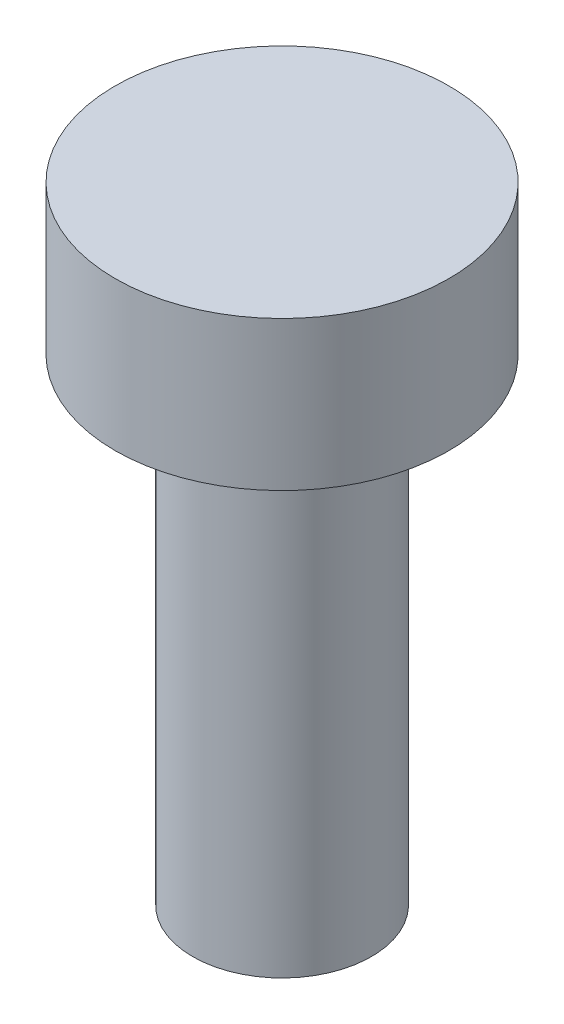
ISO-10303-21;
HEADER;
FILE_DESCRIPTION(('STEP AP214'),'2;1');
FILE_NAME('part.step','',(''),(''),'','','');
FILE_SCHEMA(('AUTOMOTIVE_DESIGN { 1 0 10303 214 1 1 1 1 }'));
ENDSEC;
DATA;
#1=APPLICATION_CONTEXT('core data for automotive mechanical design processes');
#2=APPLICATION_PROTOCOL_DEFINITION('international standard','automotive_design',2000,#1);
#3=PRODUCT_CONTEXT('',#1,'mechanical');
#4=PRODUCT('Part','Part','',(#3));
#5=PRODUCT_RELATED_PRODUCT_CATEGORY('part','',(#4));
#6=PRODUCT_DEFINITION_FORMATION('','',#4);
#7=PRODUCT_DEFINITION_CONTEXT('part definition',#1,'design');
#8=PRODUCT_DEFINITION('design','',#6,#7);
#9=PRODUCT_DEFINITION_SHAPE('','',#8);
#10=(LENGTH_UNIT() NAMED_UNIT(*) SI_UNIT(.MILLI.,.METRE.));
#11=(NAMED_UNIT(*) PLANE_ANGLE_UNIT() SI_UNIT($,.RADIAN.));
#12=(NAMED_UNIT(*) SI_UNIT($,.STERADIAN.) SOLID_ANGLE_UNIT());
#13=UNCERTAINTY_MEASURE_WITH_UNIT(LENGTH_MEASURE(1.E-05),#10,'distance_accuracy_value','');
#14=(GEOMETRIC_REPRESENTATION_CONTEXT(3) GLOBAL_UNCERTAINTY_ASSIGNED_CONTEXT((#13)) GLOBAL_UNIT_ASSIGNED_CONTEXT((#10,
#11,#12)) REPRESENTATION_CONTEXT('',''));
#15=CARTESIAN_POINT('',(0.,0.,0.));
#16=DIRECTION('',(0.,0.,1.));
#17=DIRECTION('',(1.,0.,0.));
#18=AXIS2_PLACEMENT_3D('',#15,#16,#17);
#19=CARTESIAN_POINT('',(0.,8.,0.));
#20=DIRECTION('',(0.,-1.,0.));
#21=DIRECTION('',(0.,0.,-1.));
#22=AXIS2_PLACEMENT_3D('',#19,#20,#21);
#23=CYLINDRICAL_SURFACE('',#22,1.5);
#24=CARTESIAN_POINT('',(0.,8.,0.));
#25=DIRECTION('',(0.,1.,0.));
#26=DIRECTION('',(0.,0.,1.));
#27=AXIS2_PLACEMENT_3D('',#24,#25,#26);
#28=CIRCLE('',#27,1.5);
#29=CARTESIAN_POINT('',(0.,8.,1.5));
#30=VERTEX_POINT('',#29);
#31=EDGE_CURVE('E10',#30,#30,#28,.T.);
#32=ORIENTED_EDGE('',*,*,#31,.F.);
#33=EDGE_LOOP('',(#32));
#34=FACE_BOUND('',#33,.T.);
#35=CARTESIAN_POINT('',(0.,0.,0.));
#36=DIRECTION('',(0.,1.,0.));
#37=DIRECTION('',(0.,0.,1.));
#38=AXIS2_PLACEMENT_3D('',#35,#36,#37);
#39=CIRCLE('',#38,1.5);
#40=CARTESIAN_POINT('',(0.,0.,1.5));
#41=VERTEX_POINT('',#40);
#42=EDGE_CURVE('E36',#41,#41,#39,.T.);
#43=ORIENTED_EDGE('',*,*,#42,.T.);
#44=EDGE_LOOP('',(#43));
#45=FACE_BOUND('',#44,.T.);
#46=ADVANCED_FACE('F33',(#34,#45),#23,.T.);
#47=CARTESIAN_POINT('',(0.,0.,0.));
#48=DIRECTION('',(0.,1.,0.));
#49=DIRECTION('',(0.,0.,1.));
#50=AXIS2_PLACEMENT_3D('',#47,#48,#49);
#51=PLANE('',#50);
#52=ORIENTED_EDGE('',*,*,#42,.F.);
#53=EDGE_LOOP('',(#52));
#54=FACE_BOUND('',#53,.T.);
#55=ADVANCED_FACE('F56',(#54),#51,.F.);
#56=CARTESIAN_POINT('',(0.,10.5,0.));
#57=DIRECTION('',(0.,-1.,0.));
#58=DIRECTION('',(0.,0.,-1.));
#59=AXIS2_PLACEMENT_3D('',#56,#57,#58);
#60=CYLINDRICAL_SURFACE('',#59,2.8);
#61=CARTESIAN_POINT('',(0.,10.5,0.));
#62=DIRECTION('',(0.,1.,0.));
#63=DIRECTION('',(0.,0.,1.));
#64=AXIS2_PLACEMENT_3D('',#61,#62,#63);
#65=CIRCLE('',#64,2.8);
#66=CARTESIAN_POINT('',(0.,10.5,2.8));
#67=VERTEX_POINT('',#66);
#68=EDGE_CURVE('E43',#67,#67,#65,.T.);
#69=ORIENTED_EDGE('',*,*,#68,.F.);
#70=EDGE_LOOP('',(#69));
#71=FACE_BOUND('',#70,.T.);
#72=CARTESIAN_POINT('',(0.,8.,0.));
#73=DIRECTION('',(0.,1.,0.));
#74=DIRECTION('',(0.,0.,1.));
#75=AXIS2_PLACEMENT_3D('',#72,#73,#74);
#76=CIRCLE('',#75,2.8);
#77=CARTESIAN_POINT('',(0.,8.,2.8));
#78=VERTEX_POINT('',#77);
#79=EDGE_CURVE('E45',#78,#78,#76,.T.);
#80=ORIENTED_EDGE('',*,*,#79,.T.);
#81=EDGE_LOOP('',(#80));
#82=FACE_BOUND('',#81,.T.);
#83=ADVANCED_FACE('F53',(#71,#82),#60,.T.);
#84=CARTESIAN_POINT('',(0.,10.5,0.));
#85=DIRECTION('',(0.,1.,0.));
#86=DIRECTION('',(0.,0.,1.));
#87=AXIS2_PLACEMENT_3D('',#84,#85,#86);
#88=PLANE('',#87);
#89=ORIENTED_EDGE('',*,*,#68,.T.);
#90=EDGE_LOOP('',(#89));
#91=FACE_BOUND('',#90,.T.);
#92=ADVANCED_FACE('F51',(#91),#88,.T.);
#93=CARTESIAN_POINT('',(0.,8.,0.));
#94=DIRECTION('',(0.,1.,0.));
#95=DIRECTION('',(0.,0.,1.));
#96=AXIS2_PLACEMENT_3D('',#93,#94,#95);
#97=PLANE('',#96);
#98=ORIENTED_EDGE('',*,*,#31,.T.);
#99=EDGE_LOOP('',(#98));
#100=FACE_BOUND('',#99,.T.);
#101=ORIENTED_EDGE('',*,*,#79,.F.);
#102=EDGE_LOOP('',(#101));
#103=FACE_BOUND('',#102,.T.);
#104=ADVANCED_FACE('F60',(#100,#103),#97,.F.);
#105=CLOSED_SHELL('',(#46,#55,#83,#92,#104));
#106=MANIFOLD_SOLID_BREP('B2',#105);
#107=ADVANCED_BREP_SHAPE_REPRESENTATION('',(#18,#106),#14);
#108=SHAPE_DEFINITION_REPRESENTATION(#9,#107);
ENDSEC;
END-ISO-10303-21;
